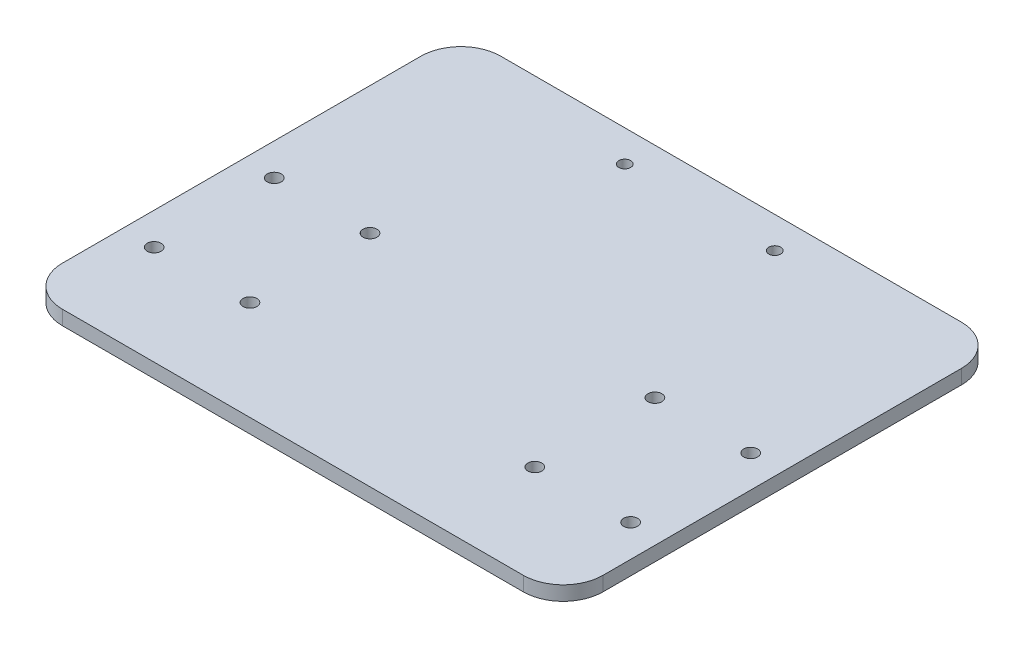
ISO-10303-21;
HEADER;
FILE_DESCRIPTION(('STEP AP214'),'2;1');
FILE_NAME('part.step','',(''),(''),'','','');
FILE_SCHEMA(('AUTOMOTIVE_DESIGN { 1 0 10303 214 1 1 1 1 }'));
ENDSEC;
DATA;
#1=APPLICATION_CONTEXT('core data for automotive mechanical design processes');
#2=APPLICATION_PROTOCOL_DEFINITION('international standard','automotive_design',2000,#1);
#3=PRODUCT_CONTEXT('',#1,'mechanical');
#4=PRODUCT('Part','Part','',(#3));
#5=PRODUCT_RELATED_PRODUCT_CATEGORY('part','',(#4));
#6=PRODUCT_DEFINITION_FORMATION('','',#4);
#7=PRODUCT_DEFINITION_CONTEXT('part definition',#1,'design');
#8=PRODUCT_DEFINITION('design','',#6,#7);
#9=PRODUCT_DEFINITION_SHAPE('','',#8);
#10=(LENGTH_UNIT() NAMED_UNIT(*) SI_UNIT(.MILLI.,.METRE.));
#11=(NAMED_UNIT(*) PLANE_ANGLE_UNIT() SI_UNIT($,.RADIAN.));
#12=(NAMED_UNIT(*) SI_UNIT($,.STERADIAN.) SOLID_ANGLE_UNIT());
#13=UNCERTAINTY_MEASURE_WITH_UNIT(LENGTH_MEASURE(1.E-05),#10,'distance_accuracy_value','');
#14=(GEOMETRIC_REPRESENTATION_CONTEXT(3) GLOBAL_UNCERTAINTY_ASSIGNED_CONTEXT((#13)) GLOBAL_UNIT_ASSIGNED_CONTEXT((#10,
#11,#12)) REPRESENTATION_CONTEXT('',''));
#15=CARTESIAN_POINT('',(0.,0.,0.));
#16=DIRECTION('',(0.,0.,1.));
#17=DIRECTION('',(1.,0.,0.));
#18=AXIS2_PLACEMENT_3D('',#15,#16,#17);
#19=CARTESIAN_POINT('',(152.763732603223,3.6,-40.));
#20=DIRECTION('',(0.,-1.,0.));
#21=DIRECTION('',(0.,0.,-1.));
#22=AXIS2_PLACEMENT_3D('',#19,#20,#21);
#23=CYLINDRICAL_SURFACE('',#22,10.);
#24=DIRECTION('',(0.,1.,0.));
#25=VECTOR('',#24,1.);
#26=CARTESIAN_POINT('',(152.763732603223,3.6,-30.));
#27=LINE('',#26,#25);
#28=CARTESIAN_POINT('',(152.763732603223,0.,-30.));
#29=VERTEX_POINT('',#28);
#30=CARTESIAN_POINT('',(152.763732603223,3.6,-30.));
#31=VERTEX_POINT('',#30);
#32=EDGE_CURVE('E185',#29,#31,#27,.T.);
#33=ORIENTED_EDGE('',*,*,#32,.F.);
#34=CARTESIAN_POINT('',(152.763732603223,0.,-40.));
#35=DIRECTION('',(0.,1.,0.));
#36=DIRECTION('',(0.,0.,1.));
#37=AXIS2_PLACEMENT_3D('',#34,#35,#36);
#38=CIRCLE('',#37,10.);
#39=CARTESIAN_POINT('',(162.763732603223,0.,-40.));
#40=VERTEX_POINT('',#39);
#41=EDGE_CURVE('E42',#40,#29,#38,.F.);
#42=ORIENTED_EDGE('',*,*,#41,.F.);
#43=DIRECTION('',(0.,1.,0.));
#44=VECTOR('',#43,1.);
#45=CARTESIAN_POINT('',(162.763732603223,3.6,-40.));
#46=LINE('',#45,#44);
#47=CARTESIAN_POINT('',(162.763732603223,3.6,-40.));
#48=VERTEX_POINT('',#47);
#49=EDGE_CURVE('E187',#48,#40,#46,.F.);
#50=ORIENTED_EDGE('',*,*,#49,.F.);
#51=CARTESIAN_POINT('',(152.763732603223,3.6,-40.));
#52=DIRECTION('',(0.,1.,0.));
#53=DIRECTION('',(0.,0.,1.));
#54=AXIS2_PLACEMENT_3D('',#51,#52,#53);
#55=CIRCLE('',#54,10.);
#56=EDGE_CURVE('E11',#31,#48,#55,.T.);
#57=ORIENTED_EDGE('',*,*,#56,.F.);
#58=EDGE_LOOP('',(#33,#42,#50,#57));
#59=FACE_BOUND('',#58,.T.);
#60=ADVANCED_FACE('F35',(#59),#23,.T.);
#61=CARTESIAN_POINT('',(152.763732603223,3.6,-129.875291840671));
#62=DIRECTION('',(0.,-1.,0.));
#63=DIRECTION('',(0.,0.,-1.));
#64=AXIS2_PLACEMENT_3D('',#61,#62,#63);
#65=CYLINDRICAL_SURFACE('',#64,10.);
#66=DIRECTION('',(0.,-1.,0.));
#67=VECTOR('',#66,1.);
#68=CARTESIAN_POINT('',(152.763732603223,3.6,-139.875291840671));
#69=LINE('',#68,#67);
#70=CARTESIAN_POINT('',(152.763732603223,3.6,-139.875291840671));
#71=VERTEX_POINT('',#70);
#72=CARTESIAN_POINT('',(152.763732603223,0.,-139.875291840671));
#73=VERTEX_POINT('',#72);
#74=EDGE_CURVE('E175',#71,#73,#69,.T.);
#75=ORIENTED_EDGE('',*,*,#74,.F.);
#76=CARTESIAN_POINT('',(152.763732603223,3.6,-129.875291840671));
#77=DIRECTION('',(0.,1.,0.));
#78=DIRECTION('',(0.,0.,1.));
#79=AXIS2_PLACEMENT_3D('',#76,#77,#78);
#80=CIRCLE('',#79,10.);
#81=CARTESIAN_POINT('',(162.763732603223,3.6,-129.875291840671));
#82=VERTEX_POINT('',#81);
#83=EDGE_CURVE('E181',#82,#71,#80,.T.);
#84=ORIENTED_EDGE('',*,*,#83,.F.);
#85=DIRECTION('',(0.,-1.,0.));
#86=VECTOR('',#85,1.);
#87=CARTESIAN_POINT('',(162.763732603223,3.6,-129.875291840671));
#88=LINE('',#87,#86);
#89=CARTESIAN_POINT('',(162.763732603223,0.,-129.875291840671));
#90=VERTEX_POINT('',#89);
#91=EDGE_CURVE('E178',#90,#82,#88,.F.);
#92=ORIENTED_EDGE('',*,*,#91,.F.);
#93=CARTESIAN_POINT('',(152.763732603223,0.,-129.875291840671));
#94=DIRECTION('',(0.,1.,0.));
#95=DIRECTION('',(0.,0.,1.));
#96=AXIS2_PLACEMENT_3D('',#93,#94,#95);
#97=CIRCLE('',#96,10.);
#98=EDGE_CURVE('E183',#73,#90,#97,.F.);
#99=ORIENTED_EDGE('',*,*,#98,.F.);
#100=EDGE_LOOP('',(#75,#84,#92,#99));
#101=FACE_BOUND('',#100,.T.);
#102=ADVANCED_FACE('F197',(#101),#65,.T.);
#103=CARTESIAN_POINT('',(37.2362673967767,3.6,-129.875291840671));
#104=DIRECTION('',(0.,1.,0.));
#105=DIRECTION('',(0.,0.,1.));
#106=AXIS2_PLACEMENT_3D('',#103,#104,#105);
#107=CYLINDRICAL_SURFACE('',#106,10.);
#108=DIRECTION('',(0.,-1.,0.));
#109=VECTOR('',#108,1.);
#110=CARTESIAN_POINT('',(27.2362673967767,3.6,-129.875291840671));
#111=LINE('',#110,#109);
#112=CARTESIAN_POINT('',(27.2362673967767,3.6,-129.875291840671));
#113=VERTEX_POINT('',#112);
#114=CARTESIAN_POINT('',(27.2362673967767,0.,-129.875291840671));
#115=VERTEX_POINT('',#114);
#116=EDGE_CURVE('E109',#113,#115,#111,.T.);
#117=ORIENTED_EDGE('',*,*,#116,.F.);
#118=CARTESIAN_POINT('',(37.2362673967767,3.6,-129.875291840671));
#119=DIRECTION('',(0.,1.,0.));
#120=DIRECTION('',(0.,0.,1.));
#121=AXIS2_PLACEMENT_3D('',#118,#119,#120);
#122=CIRCLE('',#121,10.);
#123=CARTESIAN_POINT('',(37.2362673967767,3.6,-139.875291840671));
#124=VERTEX_POINT('',#123);
#125=EDGE_CURVE('E171',#124,#113,#122,.T.);
#126=ORIENTED_EDGE('',*,*,#125,.F.);
#127=DIRECTION('',(0.,-1.,0.));
#128=VECTOR('',#127,1.);
#129=CARTESIAN_POINT('',(37.2362673967767,3.6,-139.875291840671));
#130=LINE('',#129,#128);
#131=CARTESIAN_POINT('',(37.2362673967767,0.,-139.875291840671));
#132=VERTEX_POINT('',#131);
#133=EDGE_CURVE('E168',#132,#124,#130,.F.);
#134=ORIENTED_EDGE('',*,*,#133,.F.);
#135=CARTESIAN_POINT('',(37.2362673967767,0.,-129.875291840671));
#136=DIRECTION('',(0.,1.,0.));
#137=DIRECTION('',(0.,0.,1.));
#138=AXIS2_PLACEMENT_3D('',#135,#136,#137);
#139=CIRCLE('',#138,10.);
#140=EDGE_CURVE('E173',#115,#132,#139,.F.);
#141=ORIENTED_EDGE('',*,*,#140,.F.);
#142=EDGE_LOOP('',(#117,#126,#134,#141));
#143=FACE_BOUND('',#142,.T.);
#144=ADVANCED_FACE('F255',(#143),#107,.T.);
#145=CARTESIAN_POINT('',(37.2362673967768,3.6,-40.));
#146=DIRECTION('',(0.,-1.,0.));
#147=DIRECTION('',(0.,0.,-1.));
#148=AXIS2_PLACEMENT_3D('',#145,#146,#147);
#149=CYLINDRICAL_SURFACE('',#148,10.);
#150=DIRECTION('',(0.,-1.,0.));
#151=VECTOR('',#150,1.);
#152=CARTESIAN_POINT('',(37.2362673967768,3.6,-30.));
#153=LINE('',#152,#151);
#154=CARTESIAN_POINT('',(37.2362673967768,3.6,-30.));
#155=VERTEX_POINT('',#154);
#156=CARTESIAN_POINT('',(37.2362673967768,0.,-30.));
#157=VERTEX_POINT('',#156);
#158=EDGE_CURVE('E102',#155,#157,#153,.T.);
#159=ORIENTED_EDGE('',*,*,#158,.F.);
#160=CARTESIAN_POINT('',(37.2362673967768,3.6,-40.));
#161=DIRECTION('',(0.,1.,0.));
#162=DIRECTION('',(0.,0.,1.));
#163=AXIS2_PLACEMENT_3D('',#160,#161,#162);
#164=CIRCLE('',#163,10.);
#165=CARTESIAN_POINT('',(27.2362673967768,3.6,-40.));
#166=VERTEX_POINT('',#165);
#167=EDGE_CURVE('E110',#166,#155,#164,.T.);
#168=ORIENTED_EDGE('',*,*,#167,.F.);
#169=DIRECTION('',(0.,-1.,0.));
#170=VECTOR('',#169,1.);
#171=CARTESIAN_POINT('',(27.2362673967768,3.6,-40.));
#172=LINE('',#171,#170);
#173=CARTESIAN_POINT('',(27.2362673967768,0.,-40.));
#174=VERTEX_POINT('',#173);
#175=EDGE_CURVE('E105',#174,#166,#172,.F.);
#176=ORIENTED_EDGE('',*,*,#175,.F.);
#177=CARTESIAN_POINT('',(37.2362673967768,0.,-40.));
#178=DIRECTION('',(0.,1.,0.));
#179=DIRECTION('',(0.,0.,1.));
#180=AXIS2_PLACEMENT_3D('',#177,#178,#179);
#181=CIRCLE('',#180,10.);
#182=EDGE_CURVE('E98',#157,#174,#181,.F.);
#183=ORIENTED_EDGE('',*,*,#182,.F.);
#184=EDGE_LOOP('',(#159,#168,#176,#183));
#185=FACE_BOUND('',#184,.T.);
#186=ADVANCED_FACE('F100',(#185),#149,.T.);
#187=CARTESIAN_POINT('',(0.,3.6,-30.));
#188=DIRECTION('',(0.,0.,-1.));
#189=DIRECTION('',(-1.,0.,0.));
#190=AXIS2_PLACEMENT_3D('',#187,#188,#189);
#191=PLANE('',#190);
#192=DIRECTION('',(1.,0.,0.));
#193=VECTOR('',#192,1.);
#194=CARTESIAN_POINT('',(0.,0.,-30.));
#195=LINE('',#194,#193);
#196=EDGE_CURVE('E116',#157,#29,#195,.T.);
#197=ORIENTED_EDGE('',*,*,#196,.T.);
#198=ORIENTED_EDGE('',*,*,#32,.T.);
#199=DIRECTION('',(1.,0.,0.));
#200=VECTOR('',#199,1.);
#201=CARTESIAN_POINT('',(0.,3.6,-30.));
#202=LINE('',#201,#200);
#203=EDGE_CURVE('E117',#155,#31,#202,.T.);
#204=ORIENTED_EDGE('',*,*,#203,.F.);
#205=ORIENTED_EDGE('',*,*,#158,.T.);
#206=EDGE_LOOP('',(#197,#198,#204,#205));
#207=FACE_BOUND('',#206,.T.);
#208=ADVANCED_FACE('F114',(#207),#191,.F.);
#209=CARTESIAN_POINT('',(162.763732603223,3.6,0.));
#210=DIRECTION('',(1.,0.,0.));
#211=DIRECTION('',(0.,0.,-1.));
#212=AXIS2_PLACEMENT_3D('',#209,#210,#211);
#213=PLANE('',#212);
#214=DIRECTION('',(0.,0.,1.));
#215=VECTOR('',#214,1.);
#216=CARTESIAN_POINT('',(162.763732603223,3.6,0.));
#217=LINE('',#216,#215);
#218=EDGE_CURVE('E192',#82,#48,#217,.T.);
#219=ORIENTED_EDGE('',*,*,#218,.T.);
#220=ORIENTED_EDGE('',*,*,#49,.T.);
#221=DIRECTION('',(0.,0.,1.));
#222=VECTOR('',#221,1.);
#223=CARTESIAN_POINT('',(162.763732603223,0.,0.));
#224=LINE('',#223,#222);
#225=EDGE_CURVE('E123',#90,#40,#224,.T.);
#226=ORIENTED_EDGE('',*,*,#225,.F.);
#227=ORIENTED_EDGE('',*,*,#91,.T.);
#228=EDGE_LOOP('',(#219,#220,#226,#227));
#229=FACE_BOUND('',#228,.T.);
#230=ADVANCED_FACE('F191',(#229),#213,.T.);
#231=CARTESIAN_POINT('',(0.,3.6,-139.875291840671));
#232=DIRECTION('',(0.,0.,-1.));
#233=DIRECTION('',(-1.,0.,0.));
#234=AXIS2_PLACEMENT_3D('',#231,#232,#233);
#235=PLANE('',#234);
#236=DIRECTION('',(1.,0.,0.));
#237=VECTOR('',#236,1.);
#238=CARTESIAN_POINT('',(0.,3.6,-139.875291840671));
#239=LINE('',#238,#237);
#240=EDGE_CURVE('E201',#124,#71,#239,.T.);
#241=ORIENTED_EDGE('',*,*,#240,.T.);
#242=ORIENTED_EDGE('',*,*,#74,.T.);
#243=DIRECTION('',(1.,0.,0.));
#244=VECTOR('',#243,1.);
#245=CARTESIAN_POINT('',(0.,0.,-139.875291840671));
#246=LINE('',#245,#244);
#247=EDGE_CURVE('E125',#132,#73,#246,.T.);
#248=ORIENTED_EDGE('',*,*,#247,.F.);
#249=ORIENTED_EDGE('',*,*,#133,.T.);
#250=EDGE_LOOP('',(#241,#242,#248,#249));
#251=FACE_BOUND('',#250,.T.);
#252=ADVANCED_FACE('F262',(#251),#235,.T.);
#253=CARTESIAN_POINT('',(113.799999999999,3.6,-132.));
#254=DIRECTION('',(0.,-1.,0.));
#255=DIRECTION('',(0.,0.,-1.));
#256=AXIS2_PLACEMENT_3D('',#253,#254,#255);
#257=CYLINDRICAL_SURFACE('',#256,1.5);
#258=CARTESIAN_POINT('',(113.799999999999,3.6,-132.));
#259=DIRECTION('',(0.,1.,0.));
#260=DIRECTION('',(0.,0.,1.));
#261=AXIS2_PLACEMENT_3D('',#258,#259,#260);
#262=CIRCLE('',#261,1.5);
#263=CARTESIAN_POINT('',(113.799999999999,3.6,-130.5));
#264=VERTEX_POINT('',#263);
#265=EDGE_CURVE('E232',#264,#264,#262,.F.);
#266=ORIENTED_EDGE('',*,*,#265,.F.);
#267=EDGE_LOOP('',(#266));
#268=FACE_BOUND('',#267,.T.);
#269=CARTESIAN_POINT('',(113.799999999999,0.,-132.));
#270=DIRECTION('',(0.,1.,0.));
#271=DIRECTION('',(0.,0.,1.));
#272=AXIS2_PLACEMENT_3D('',#269,#270,#271);
#273=CIRCLE('',#272,1.5);
#274=CARTESIAN_POINT('',(113.799999999999,0.,-130.5));
#275=VERTEX_POINT('',#274);
#276=EDGE_CURVE('E158',#275,#275,#273,.F.);
#277=ORIENTED_EDGE('',*,*,#276,.T.);
#278=EDGE_LOOP('',(#277));
#279=FACE_BOUND('',#278,.T.);
#280=ADVANCED_FACE('F264',(#268,#279),#257,.F.);
#281=CARTESIAN_POINT('',(35.2862673967768,3.6,-54.9499999999998));
#282=DIRECTION('',(0.,-1.,0.));
#283=DIRECTION('',(0.,0.,-1.));
#284=AXIS2_PLACEMENT_3D('',#281,#282,#283);
#285=CYLINDRICAL_SURFACE('',#284,1.75);
#286=CARTESIAN_POINT('',(35.2862673967768,3.6,-54.9499999999998));
#287=DIRECTION('',(0.,1.,0.));
#288=DIRECTION('',(0.,0.,1.));
#289=AXIS2_PLACEMENT_3D('',#286,#287,#288);
#290=CIRCLE('',#289,1.75);
#291=CARTESIAN_POINT('',(35.2862673967768,3.6,-53.1999999999999));
#292=VERTEX_POINT('',#291);
#293=EDGE_CURVE('E230',#292,#292,#290,.F.);
#294=ORIENTED_EDGE('',*,*,#293,.F.);
#295=EDGE_LOOP('',(#294));
#296=FACE_BOUND('',#295,.T.);
#297=CARTESIAN_POINT('',(35.2862673967768,0.,-54.9499999999998));
#298=DIRECTION('',(0.,1.,0.));
#299=DIRECTION('',(0.,0.,1.));
#300=AXIS2_PLACEMENT_3D('',#297,#298,#299);
#301=CIRCLE('',#300,1.75);
#302=CARTESIAN_POINT('',(35.2862673967768,0.,-53.1999999999999));
#303=VERTEX_POINT('',#302);
#304=EDGE_CURVE('E155',#303,#303,#301,.F.);
#305=ORIENTED_EDGE('',*,*,#304,.T.);
#306=EDGE_LOOP('',(#305));
#307=FACE_BOUND('',#306,.T.);
#308=ADVANCED_FACE('F270',(#296,#307),#285,.F.);
#309=CARTESIAN_POINT('',(59.2862673967768,3.6,-85.0500000000002));
#310=DIRECTION('',(0.,-1.,0.));
#311=DIRECTION('',(0.,0.,-1.));
#312=AXIS2_PLACEMENT_3D('',#309,#310,#311);
#313=CYLINDRICAL_SURFACE('',#312,1.75);
#314=CARTESIAN_POINT('',(59.2862673967768,3.6,-85.0500000000002));
#315=DIRECTION('',(0.,1.,0.));
#316=DIRECTION('',(0.,0.,1.));
#317=AXIS2_PLACEMENT_3D('',#314,#315,#316);
#318=CIRCLE('',#317,1.75);
#319=CARTESIAN_POINT('',(59.2862673967768,3.6,-83.3000000000002));
#320=VERTEX_POINT('',#319);
#321=EDGE_CURVE('E227',#320,#320,#318,.T.);
#322=ORIENTED_EDGE('',*,*,#321,.T.);
#323=EDGE_LOOP('',(#322));
#324=FACE_BOUND('',#323,.T.);
#325=CARTESIAN_POINT('',(59.2862673967768,0.,-85.0500000000002));
#326=DIRECTION('',(0.,1.,0.));
#327=DIRECTION('',(0.,0.,1.));
#328=AXIS2_PLACEMENT_3D('',#325,#326,#327);
#329=CIRCLE('',#328,1.75);
#330=CARTESIAN_POINT('',(59.2862673967768,0.,-83.3000000000002));
#331=VERTEX_POINT('',#330);
#332=EDGE_CURVE('E152',#331,#331,#329,.T.);
#333=ORIENTED_EDGE('',*,*,#332,.F.);
#334=EDGE_LOOP('',(#333));
#335=FACE_BOUND('',#334,.T.);
#336=ADVANCED_FACE('F348',(#324,#335),#313,.F.);
#337=CARTESIAN_POINT('',(35.2862673967768,3.6,-85.0500000000002));
#338=DIRECTION('',(0.,-1.,0.));
#339=DIRECTION('',(0.,0.,-1.));
#340=AXIS2_PLACEMENT_3D('',#337,#338,#339);
#341=CYLINDRICAL_SURFACE('',#340,1.75);
#342=CARTESIAN_POINT('',(35.2862673967768,3.6,-85.0500000000002));
#343=DIRECTION('',(0.,1.,0.));
#344=DIRECTION('',(0.,0.,1.));
#345=AXIS2_PLACEMENT_3D('',#342,#343,#344);
#346=CIRCLE('',#345,1.75);
#347=CARTESIAN_POINT('',(35.2862673967768,3.6,-83.3000000000002));
#348=VERTEX_POINT('',#347);
#349=EDGE_CURVE('E224',#348,#348,#346,.T.);
#350=ORIENTED_EDGE('',*,*,#349,.T.);
#351=EDGE_LOOP('',(#350));
#352=FACE_BOUND('',#351,.T.);
#353=CARTESIAN_POINT('',(35.2862673967768,0.,-85.0500000000002));
#354=DIRECTION('',(0.,1.,0.));
#355=DIRECTION('',(0.,0.,1.));
#356=AXIS2_PLACEMENT_3D('',#353,#354,#355);
#357=CIRCLE('',#356,1.75);
#358=CARTESIAN_POINT('',(35.2862673967768,0.,-83.3000000000002));
#359=VERTEX_POINT('',#358);
#360=EDGE_CURVE('E149',#359,#359,#357,.T.);
#361=ORIENTED_EDGE('',*,*,#360,.F.);
#362=EDGE_LOOP('',(#361));
#363=FACE_BOUND('',#362,.T.);
#364=ADVANCED_FACE('F357',(#352,#363),#341,.F.);
#365=CARTESIAN_POINT('',(59.2862673967768,3.6,-54.9499999999998));
#366=DIRECTION('',(0.,-1.,0.));
#367=DIRECTION('',(0.,0.,-1.));
#368=AXIS2_PLACEMENT_3D('',#365,#366,#367);
#369=CYLINDRICAL_SURFACE('',#368,1.75);
#370=CARTESIAN_POINT('',(59.2862673967768,3.6,-54.9499999999998));
#371=DIRECTION('',(0.,1.,0.));
#372=DIRECTION('',(0.,0.,1.));
#373=AXIS2_PLACEMENT_3D('',#370,#371,#372);
#374=CIRCLE('',#373,1.75);
#375=CARTESIAN_POINT('',(59.2862673967768,3.6,-53.1999999999999));
#376=VERTEX_POINT('',#375);
#377=EDGE_CURVE('E221',#376,#376,#374,.F.);
#378=ORIENTED_EDGE('',*,*,#377,.F.);
#379=EDGE_LOOP('',(#378));
#380=FACE_BOUND('',#379,.T.);
#381=CARTESIAN_POINT('',(59.2862673967768,0.,-54.9499999999998));
#382=DIRECTION('',(0.,1.,0.));
#383=DIRECTION('',(0.,0.,1.));
#384=AXIS2_PLACEMENT_3D('',#381,#382,#383);
#385=CIRCLE('',#384,1.75);
#386=CARTESIAN_POINT('',(59.2862673967768,0.,-53.1999999999999));
#387=VERTEX_POINT('',#386);
#388=EDGE_CURVE('E146',#387,#387,#385,.F.);
#389=ORIENTED_EDGE('',*,*,#388,.T.);
#390=EDGE_LOOP('',(#389));
#391=FACE_BOUND('',#390,.T.);
#392=ADVANCED_FACE('F366',(#380,#391),#369,.F.);
#393=CARTESIAN_POINT('',(154.713732603223,3.6,-85.0500000000002));
#394=DIRECTION('',(0.,-1.,0.));
#395=DIRECTION('',(0.,0.,-1.));
#396=AXIS2_PLACEMENT_3D('',#393,#394,#395);
#397=CYLINDRICAL_SURFACE('',#396,1.74999999999998);
#398=CARTESIAN_POINT('',(154.713732603223,3.6,-85.0500000000002));
#399=DIRECTION('',(0.,1.,0.));
#400=DIRECTION('',(0.,0.,1.));
#401=AXIS2_PLACEMENT_3D('',#398,#399,#400);
#402=CIRCLE('',#401,1.74999999999998);
#403=CARTESIAN_POINT('',(154.713732603223,3.6,-83.3000000000002));
#404=VERTEX_POINT('',#403);
#405=EDGE_CURVE('E218',#404,#404,#402,.F.);
#406=ORIENTED_EDGE('',*,*,#405,.F.);
#407=EDGE_LOOP('',(#406));
#408=FACE_BOUND('',#407,.T.);
#409=CARTESIAN_POINT('',(154.713732603223,0.,-85.0500000000002));
#410=DIRECTION('',(0.,1.,0.));
#411=DIRECTION('',(0.,0.,1.));
#412=AXIS2_PLACEMENT_3D('',#409,#410,#411);
#413=CIRCLE('',#412,1.74999999999998);
#414=CARTESIAN_POINT('',(154.713732603223,0.,-83.3000000000002));
#415=VERTEX_POINT('',#414);
#416=EDGE_CURVE('E143',#415,#415,#413,.F.);
#417=ORIENTED_EDGE('',*,*,#416,.T.);
#418=EDGE_LOOP('',(#417));
#419=FACE_BOUND('',#418,.T.);
#420=ADVANCED_FACE('F375',(#408,#419),#397,.F.);
#421=CARTESIAN_POINT('',(130.713732603223,3.6,-54.9499999999998));
#422=DIRECTION('',(0.,-1.,0.));
#423=DIRECTION('',(0.,0.,-1.));
#424=AXIS2_PLACEMENT_3D('',#421,#422,#423);
#425=CYLINDRICAL_SURFACE('',#424,1.75000000000001);
#426=CARTESIAN_POINT('',(130.713732603223,3.6,-54.9499999999998));
#427=DIRECTION('',(0.,1.,0.));
#428=DIRECTION('',(0.,0.,1.));
#429=AXIS2_PLACEMENT_3D('',#426,#427,#428);
#430=CIRCLE('',#429,1.75000000000001);
#431=CARTESIAN_POINT('',(130.713732603223,3.6,-53.1999999999998));
#432=VERTEX_POINT('',#431);
#433=EDGE_CURVE('E215',#432,#432,#430,.T.);
#434=ORIENTED_EDGE('',*,*,#433,.T.);
#435=EDGE_LOOP('',(#434));
#436=FACE_BOUND('',#435,.T.);
#437=CARTESIAN_POINT('',(130.713732603223,0.,-54.9499999999998));
#438=DIRECTION('',(0.,1.,0.));
#439=DIRECTION('',(0.,0.,1.));
#440=AXIS2_PLACEMENT_3D('',#437,#438,#439);
#441=CIRCLE('',#440,1.75000000000001);
#442=CARTESIAN_POINT('',(130.713732603223,0.,-53.1999999999998));
#443=VERTEX_POINT('',#442);
#444=EDGE_CURVE('E140',#443,#443,#441,.T.);
#445=ORIENTED_EDGE('',*,*,#444,.F.);
#446=EDGE_LOOP('',(#445));
#447=FACE_BOUND('',#446,.T.);
#448=ADVANCED_FACE('F384',(#436,#447),#425,.F.);
#449=CARTESIAN_POINT('',(154.713732603223,3.6,-54.9499999999998));
#450=DIRECTION('',(0.,-1.,0.));
#451=DIRECTION('',(0.,0.,-1.));
#452=AXIS2_PLACEMENT_3D('',#449,#450,#451);
#453=CYLINDRICAL_SURFACE('',#452,1.74999999999998);
#454=CARTESIAN_POINT('',(154.713732603223,3.6,-54.9499999999998));
#455=DIRECTION('',(0.,1.,0.));
#456=DIRECTION('',(0.,0.,1.));
#457=AXIS2_PLACEMENT_3D('',#454,#455,#456);
#458=CIRCLE('',#457,1.74999999999998);
#459=CARTESIAN_POINT('',(154.713732603223,3.6,-53.1999999999999));
#460=VERTEX_POINT('',#459);
#461=EDGE_CURVE('E212',#460,#460,#458,.T.);
#462=ORIENTED_EDGE('',*,*,#461,.T.);
#463=EDGE_LOOP('',(#462));
#464=FACE_BOUND('',#463,.T.);
#465=CARTESIAN_POINT('',(154.713732603223,0.,-54.9499999999998));
#466=DIRECTION('',(0.,1.,0.));
#467=DIRECTION('',(0.,0.,1.));
#468=AXIS2_PLACEMENT_3D('',#465,#466,#467);
#469=CIRCLE('',#468,1.74999999999998);
#470=CARTESIAN_POINT('',(154.713732603223,0.,-53.1999999999999));
#471=VERTEX_POINT('',#470);
#472=EDGE_CURVE('E137',#471,#471,#469,.T.);
#473=ORIENTED_EDGE('',*,*,#472,.F.);
#474=EDGE_LOOP('',(#473));
#475=FACE_BOUND('',#474,.T.);
#476=ADVANCED_FACE('F393',(#464,#475),#453,.F.);
#477=CARTESIAN_POINT('',(130.713732603223,3.6,-85.0500000000002));
#478=DIRECTION('',(0.,-1.,0.));
#479=DIRECTION('',(0.,0.,-1.));
#480=AXIS2_PLACEMENT_3D('',#477,#478,#479);
#481=CYLINDRICAL_SURFACE('',#480,1.75000000000001);
#482=CARTESIAN_POINT('',(130.713732603223,3.6,-85.0500000000002));
#483=DIRECTION('',(0.,1.,0.));
#484=DIRECTION('',(0.,0.,1.));
#485=AXIS2_PLACEMENT_3D('',#482,#483,#484);
#486=CIRCLE('',#485,1.75000000000001);
#487=CARTESIAN_POINT('',(130.713732603223,3.6,-83.3000000000002));
#488=VERTEX_POINT('',#487);
#489=EDGE_CURVE('E209',#488,#488,#486,.F.);
#490=ORIENTED_EDGE('',*,*,#489,.F.);
#491=EDGE_LOOP('',(#490));
#492=FACE_BOUND('',#491,.T.);
#493=CARTESIAN_POINT('',(130.713732603223,0.,-85.0500000000002));
#494=DIRECTION('',(0.,1.,0.));
#495=DIRECTION('',(0.,0.,1.));
#496=AXIS2_PLACEMENT_3D('',#493,#494,#495);
#497=CIRCLE('',#496,1.75000000000001);
#498=CARTESIAN_POINT('',(130.713732603223,0.,-83.3000000000002));
#499=VERTEX_POINT('',#498);
#500=EDGE_CURVE('E134',#499,#499,#497,.F.);
#501=ORIENTED_EDGE('',*,*,#500,.T.);
#502=EDGE_LOOP('',(#501));
#503=FACE_BOUND('',#502,.T.);
#504=ADVANCED_FACE('F402',(#492,#503),#481,.F.);
#505=CARTESIAN_POINT('',(27.2362673967768,3.6,0.));
#506=DIRECTION('',(1.,0.,0.));
#507=DIRECTION('',(0.,0.,-1.));
#508=AXIS2_PLACEMENT_3D('',#505,#506,#507);
#509=PLANE('',#508);
#510=DIRECTION('',(0.,0.,1.));
#511=VECTOR('',#510,1.);
#512=CARTESIAN_POINT('',(27.2362673967768,3.6,0.));
#513=LINE('',#512,#511);
#514=EDGE_CURVE('E204',#113,#166,#513,.T.);
#515=ORIENTED_EDGE('',*,*,#514,.F.);
#516=ORIENTED_EDGE('',*,*,#116,.T.);
#517=DIRECTION('',(0.,0.,1.));
#518=VECTOR('',#517,1.);
#519=CARTESIAN_POINT('',(27.2362673967768,0.,0.));
#520=LINE('',#519,#518);
#521=EDGE_CURVE('E132',#115,#174,#520,.T.);
#522=ORIENTED_EDGE('',*,*,#521,.T.);
#523=ORIENTED_EDGE('',*,*,#175,.T.);
#524=EDGE_LOOP('',(#515,#516,#522,#523));
#525=FACE_BOUND('',#524,.T.);
#526=ADVANCED_FACE('F249',(#525),#509,.F.);
#527=CARTESIAN_POINT('',(76.1999999999994,3.6,-132.));
#528=DIRECTION('',(0.,-1.,0.));
#529=DIRECTION('',(0.,0.,-1.));
#530=AXIS2_PLACEMENT_3D('',#527,#528,#529);
#531=CYLINDRICAL_SURFACE('',#530,1.5);
#532=CARTESIAN_POINT('',(76.1999999999994,3.6,-132.));
#533=DIRECTION('',(0.,1.,0.));
#534=DIRECTION('',(0.,0.,1.));
#535=AXIS2_PLACEMENT_3D('',#532,#533,#534);
#536=CIRCLE('',#535,1.5);
#537=CARTESIAN_POINT('',(76.1999999999994,3.6,-130.5));
#538=VERTEX_POINT('',#537);
#539=EDGE_CURVE('E118',#538,#538,#536,.T.);
#540=ORIENTED_EDGE('',*,*,#539,.T.);
#541=EDGE_LOOP('',(#540));
#542=FACE_BOUND('',#541,.T.);
#543=CARTESIAN_POINT('',(76.1999999999994,0.,-132.));
#544=DIRECTION('',(0.,1.,0.));
#545=DIRECTION('',(0.,0.,1.));
#546=AXIS2_PLACEMENT_3D('',#543,#544,#545);
#547=CIRCLE('',#546,1.5);
#548=CARTESIAN_POINT('',(76.1999999999994,0.,-130.5));
#549=VERTEX_POINT('',#548);
#550=EDGE_CURVE('E161',#549,#549,#547,.T.);
#551=ORIENTED_EDGE('',*,*,#550,.F.);
#552=EDGE_LOOP('',(#551));
#553=FACE_BOUND('',#552,.T.);
#554=ADVANCED_FACE('F239',(#542,#553),#531,.F.);
#555=CARTESIAN_POINT('',(0.,3.6,0.));
#556=DIRECTION('',(0.,1.,0.));
#557=DIRECTION('',(0.,0.,1.));
#558=AXIS2_PLACEMENT_3D('',#555,#556,#557);
#559=PLANE('',#558);
#560=ORIENTED_EDGE('',*,*,#203,.T.);
#561=ORIENTED_EDGE('',*,*,#56,.T.);
#562=ORIENTED_EDGE('',*,*,#218,.F.);
#563=ORIENTED_EDGE('',*,*,#83,.T.);
#564=ORIENTED_EDGE('',*,*,#240,.F.);
#565=ORIENTED_EDGE('',*,*,#125,.T.);
#566=ORIENTED_EDGE('',*,*,#514,.T.);
#567=ORIENTED_EDGE('',*,*,#167,.T.);
#568=EDGE_LOOP('',(#560,#561,#562,#563,#564,#565,#566,#567));
#569=FACE_BOUND('',#568,.T.);
#570=ORIENTED_EDGE('',*,*,#489,.T.);
#571=EDGE_LOOP('',(#570));
#572=FACE_BOUND('',#571,.T.);
#573=ORIENTED_EDGE('',*,*,#461,.F.);
#574=EDGE_LOOP('',(#573));
#575=FACE_BOUND('',#574,.T.);
#576=ORIENTED_EDGE('',*,*,#433,.F.);
#577=EDGE_LOOP('',(#576));
#578=FACE_BOUND('',#577,.T.);
#579=ORIENTED_EDGE('',*,*,#405,.T.);
#580=EDGE_LOOP('',(#579));
#581=FACE_BOUND('',#580,.T.);
#582=ORIENTED_EDGE('',*,*,#377,.T.);
#583=EDGE_LOOP('',(#582));
#584=FACE_BOUND('',#583,.T.);
#585=ORIENTED_EDGE('',*,*,#349,.F.);
#586=EDGE_LOOP('',(#585));
#587=FACE_BOUND('',#586,.T.);
#588=ORIENTED_EDGE('',*,*,#321,.F.);
#589=EDGE_LOOP('',(#588));
#590=FACE_BOUND('',#589,.T.);
#591=ORIENTED_EDGE('',*,*,#293,.T.);
#592=EDGE_LOOP('',(#591));
#593=FACE_BOUND('',#592,.T.);
#594=ORIENTED_EDGE('',*,*,#265,.T.);
#595=EDGE_LOOP('',(#594));
#596=FACE_BOUND('',#595,.T.);
#597=ORIENTED_EDGE('',*,*,#539,.F.);
#598=EDGE_LOOP('',(#597));
#599=FACE_BOUND('',#598,.T.);
#600=ADVANCED_FACE('F198',(#569,#572,#575,#578,#581,#584,#587,#590,#593,#596,#599),#559,.T.);
#601=CARTESIAN_POINT('',(0.,0.,0.));
#602=DIRECTION('',(0.,1.,0.));
#603=DIRECTION('',(0.,0.,1.));
#604=AXIS2_PLACEMENT_3D('',#601,#602,#603);
#605=PLANE('',#604);
#606=ORIENTED_EDGE('',*,*,#225,.T.);
#607=ORIENTED_EDGE('',*,*,#41,.T.);
#608=ORIENTED_EDGE('',*,*,#196,.F.);
#609=ORIENTED_EDGE('',*,*,#182,.T.);
#610=ORIENTED_EDGE('',*,*,#521,.F.);
#611=ORIENTED_EDGE('',*,*,#140,.T.);
#612=ORIENTED_EDGE('',*,*,#247,.T.);
#613=ORIENTED_EDGE('',*,*,#98,.T.);
#614=EDGE_LOOP('',(#606,#607,#608,#609,#610,#611,#612,#613));
#615=FACE_BOUND('',#614,.T.);
#616=ORIENTED_EDGE('',*,*,#500,.F.);
#617=EDGE_LOOP('',(#616));
#618=FACE_BOUND('',#617,.T.);
#619=ORIENTED_EDGE('',*,*,#472,.T.);
#620=EDGE_LOOP('',(#619));
#621=FACE_BOUND('',#620,.T.);
#622=ORIENTED_EDGE('',*,*,#444,.T.);
#623=EDGE_LOOP('',(#622));
#624=FACE_BOUND('',#623,.T.);
#625=ORIENTED_EDGE('',*,*,#416,.F.);
#626=EDGE_LOOP('',(#625));
#627=FACE_BOUND('',#626,.T.);
#628=ORIENTED_EDGE('',*,*,#388,.F.);
#629=EDGE_LOOP('',(#628));
#630=FACE_BOUND('',#629,.T.);
#631=ORIENTED_EDGE('',*,*,#360,.T.);
#632=EDGE_LOOP('',(#631));
#633=FACE_BOUND('',#632,.T.);
#634=ORIENTED_EDGE('',*,*,#332,.T.);
#635=EDGE_LOOP('',(#634));
#636=FACE_BOUND('',#635,.T.);
#637=ORIENTED_EDGE('',*,*,#304,.F.);
#638=EDGE_LOOP('',(#637));
#639=FACE_BOUND('',#638,.T.);
#640=ORIENTED_EDGE('',*,*,#276,.F.);
#641=EDGE_LOOP('',(#640));
#642=FACE_BOUND('',#641,.T.);
#643=ORIENTED_EDGE('',*,*,#550,.T.);
#644=EDGE_LOOP('',(#643));
#645=FACE_BOUND('',#644,.T.);
#646=ADVANCED_FACE('F121',(#615,#618,#621,#624,#627,#630,#633,#636,#639,#642,#645),#605,.F.);
#647=CLOSED_SHELL('',(#60,#102,#144,#186,#208,#230,#252,#280,#308,#336,#364,#392,#420,#448,#476,
#504,#526,#554,#600,#646));
#648=MANIFOLD_SOLID_BREP('B2',#647);
#649=ADVANCED_BREP_SHAPE_REPRESENTATION('',(#18,#648),#14);
#650=SHAPE_DEFINITION_REPRESENTATION(#9,#649);
ENDSEC;
END-ISO-10303-21;
